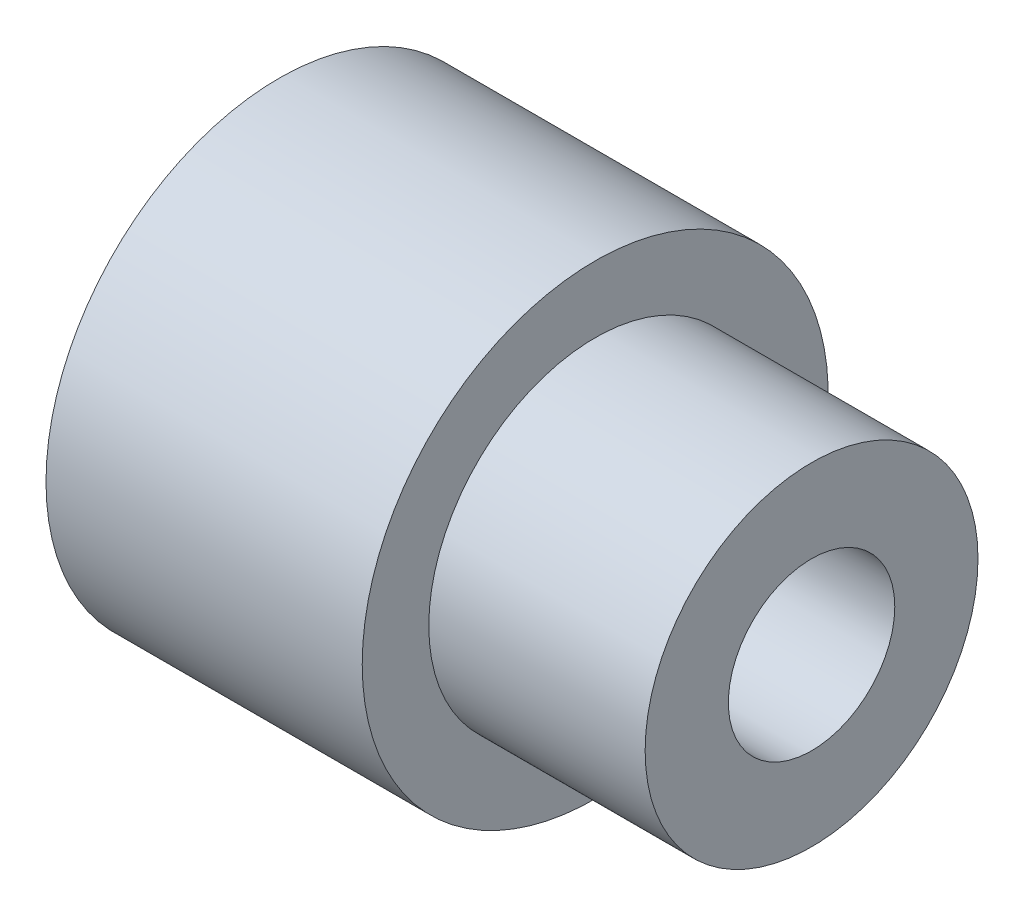
ISO-10303-21;
HEADER;
FILE_DESCRIPTION(('STEP AP214'),'2;1');
FILE_NAME('part.step','',(''),(''),'','','');
FILE_SCHEMA(('AUTOMOTIVE_DESIGN { 1 0 10303 214 1 1 1 1 }'));
ENDSEC;
DATA;
#1=APPLICATION_CONTEXT('core data for automotive mechanical design processes');
#2=APPLICATION_PROTOCOL_DEFINITION('international standard','automotive_design',2000,#1);
#3=PRODUCT_CONTEXT('',#1,'mechanical');
#4=PRODUCT('Part','Part','',(#3));
#5=PRODUCT_RELATED_PRODUCT_CATEGORY('part','',(#4));
#6=PRODUCT_DEFINITION_FORMATION('','',#4);
#7=PRODUCT_DEFINITION_CONTEXT('part definition',#1,'design');
#8=PRODUCT_DEFINITION('design','',#6,#7);
#9=PRODUCT_DEFINITION_SHAPE('','',#8);
#10=(LENGTH_UNIT() NAMED_UNIT(*) SI_UNIT(.MILLI.,.METRE.));
#11=(NAMED_UNIT(*) PLANE_ANGLE_UNIT() SI_UNIT($,.RADIAN.));
#12=(NAMED_UNIT(*) SI_UNIT($,.STERADIAN.) SOLID_ANGLE_UNIT());
#13=UNCERTAINTY_MEASURE_WITH_UNIT(LENGTH_MEASURE(1.E-05),#10,'distance_accuracy_value','');
#14=(GEOMETRIC_REPRESENTATION_CONTEXT(3) GLOBAL_UNCERTAINTY_ASSIGNED_CONTEXT((#13)) GLOBAL_UNIT_ASSIGNED_CONTEXT((#10,
#11,#12)) REPRESENTATION_CONTEXT('',''));
#15=CARTESIAN_POINT('',(0.,0.,0.));
#16=DIRECTION('',(0.,0.,1.));
#17=DIRECTION('',(1.,0.,0.));
#18=AXIS2_PLACEMENT_3D('',#15,#16,#17);
#19=CARTESIAN_POINT('',(13.,0.,0.));
#20=DIRECTION('',(-1.,0.,0.));
#21=DIRECTION('',(0.,0.,1.));
#22=AXIS2_PLACEMENT_3D('',#19,#20,#21);
#23=CYLINDRICAL_SURFACE('',#22,10.);
#24=CARTESIAN_POINT('',(13.,0.,0.));
#25=DIRECTION('',(1.,0.,0.));
#26=DIRECTION('',(0.,0.,-1.));
#27=AXIS2_PLACEMENT_3D('',#24,#25,#26);
#28=CIRCLE('',#27,10.);
#29=CARTESIAN_POINT('',(13.,0.,-10.));
#30=VERTEX_POINT('',#29);
#31=EDGE_CURVE('E43',#30,#30,#28,.T.);
#32=ORIENTED_EDGE('',*,*,#31,.F.);
#33=EDGE_LOOP('',(#32));
#34=FACE_BOUND('',#33,.T.);
#35=CARTESIAN_POINT('',(0.,0.,0.));
#36=DIRECTION('',(1.,0.,0.));
#37=DIRECTION('',(0.,0.,-1.));
#38=AXIS2_PLACEMENT_3D('',#35,#36,#37);
#39=CIRCLE('',#38,10.);
#40=CARTESIAN_POINT('',(0.,0.,-10.));
#41=VERTEX_POINT('',#40);
#42=EDGE_CURVE('E47',#41,#41,#39,.T.);
#43=ORIENTED_EDGE('',*,*,#42,.T.);
#44=EDGE_LOOP('',(#43));
#45=FACE_BOUND('',#44,.T.);
#46=ADVANCED_FACE('F32',(#34,#45),#23,.T.);
#47=CARTESIAN_POINT('',(13.,0.,0.));
#48=DIRECTION('',(1.,0.,0.));
#49=DIRECTION('',(0.,0.,-1.));
#50=AXIS2_PLACEMENT_3D('',#47,#48,#49);
#51=PLANE('',#50);
#52=CARTESIAN_POINT('',(13.,0.,0.));
#53=DIRECTION('',(1.,0.,0.));
#54=DIRECTION('',(0.,0.,-1.));
#55=AXIS2_PLACEMENT_3D('',#52,#53,#54);
#56=CIRCLE('',#55,5.);
#57=CARTESIAN_POINT('',(13.,0.,-5.));
#58=VERTEX_POINT('',#57);
#59=EDGE_CURVE('E54',#58,#58,#56,.T.);
#60=ORIENTED_EDGE('',*,*,#59,.F.);
#61=EDGE_LOOP('',(#60));
#62=FACE_BOUND('',#61,.T.);
#63=ORIENTED_EDGE('',*,*,#31,.T.);
#64=EDGE_LOOP('',(#63));
#65=FACE_BOUND('',#64,.T.);
#66=ADVANCED_FACE('F76',(#62,#65),#51,.T.);
#67=CARTESIAN_POINT('',(-19.,0.,0.));
#68=DIRECTION('',(1.,0.,0.));
#69=DIRECTION('',(0.,0.,-1.));
#70=AXIS2_PLACEMENT_3D('',#67,#68,#69);
#71=CYLINDRICAL_SURFACE('',#70,14.);
#72=CARTESIAN_POINT('',(-19.,0.,0.));
#73=DIRECTION('',(-1.,0.,0.));
#74=DIRECTION('',(0.,0.,1.));
#75=AXIS2_PLACEMENT_3D('',#72,#73,#74);
#76=CIRCLE('',#75,14.);
#77=CARTESIAN_POINT('',(-19.,0.,14.));
#78=VERTEX_POINT('',#77);
#79=EDGE_CURVE('E56',#78,#78,#76,.T.);
#80=ORIENTED_EDGE('',*,*,#79,.F.);
#81=EDGE_LOOP('',(#80));
#82=FACE_BOUND('',#81,.T.);
#83=CARTESIAN_POINT('',(0.,0.,0.));
#84=DIRECTION('',(-1.,0.,0.));
#85=DIRECTION('',(0.,0.,1.));
#86=AXIS2_PLACEMENT_3D('',#83,#84,#85);
#87=CIRCLE('',#86,14.);
#88=CARTESIAN_POINT('',(0.,0.,14.));
#89=VERTEX_POINT('',#88);
#90=EDGE_CURVE('E58',#89,#89,#87,.T.);
#91=ORIENTED_EDGE('',*,*,#90,.T.);
#92=EDGE_LOOP('',(#91));
#93=FACE_BOUND('',#92,.T.);
#94=ADVANCED_FACE('F79',(#82,#93),#71,.T.);
#95=CARTESIAN_POINT('',(-19.,0.,0.));
#96=DIRECTION('',(-1.,0.,0.));
#97=DIRECTION('',(0.,0.,1.));
#98=AXIS2_PLACEMENT_3D('',#95,#96,#97);
#99=PLANE('',#98);
#100=CARTESIAN_POINT('',(-19.,0.,0.));
#101=DIRECTION('',(-1.,0.,0.));
#102=DIRECTION('',(0.,0.,1.));
#103=AXIS2_PLACEMENT_3D('',#100,#101,#102);
#104=CIRCLE('',#103,11.05);
#105=CARTESIAN_POINT('',(-19.,0.,11.05));
#106=VERTEX_POINT('',#105);
#107=EDGE_CURVE('E10',#106,#106,#104,.F.);
#108=ORIENTED_EDGE('',*,*,#107,.T.);
#109=EDGE_LOOP('',(#108));
#110=FACE_BOUND('',#109,.T.);
#111=ORIENTED_EDGE('',*,*,#79,.T.);
#112=EDGE_LOOP('',(#111));
#113=FACE_BOUND('',#112,.T.);
#114=ADVANCED_FACE('F91',(#110,#113),#99,.T.);
#115=CARTESIAN_POINT('',(0.,0.,0.));
#116=DIRECTION('',(-1.,0.,0.));
#117=DIRECTION('',(0.,0.,1.));
#118=AXIS2_PLACEMENT_3D('',#115,#116,#117);
#119=PLANE('',#118);
#120=ORIENTED_EDGE('',*,*,#42,.F.);
#121=EDGE_LOOP('',(#120));
#122=FACE_BOUND('',#121,.T.);
#123=ORIENTED_EDGE('',*,*,#90,.F.);
#124=EDGE_LOOP('',(#123));
#125=FACE_BOUND('',#124,.T.);
#126=ADVANCED_FACE('F87',(#122,#125),#119,.F.);
#127=CARTESIAN_POINT('',(-13.,0.,0.));
#128=DIRECTION('',(-1.,0.,0.));
#129=DIRECTION('',(0.,0.,1.));
#130=AXIS2_PLACEMENT_3D('',#127,#128,#129);
#131=CYLINDRICAL_SURFACE('',#130,11.);
#132=CARTESIAN_POINT('',(-18.95,0.,0.));
#133=DIRECTION('',(-1.,0.,0.));
#134=DIRECTION('',(0.,0.,1.));
#135=AXIS2_PLACEMENT_3D('',#132,#133,#134);
#136=CIRCLE('',#135,11.);
#137=CARTESIAN_POINT('',(-18.95,0.,11.));
#138=VERTEX_POINT('',#137);
#139=EDGE_CURVE('E39',#138,#138,#136,.T.);
#140=ORIENTED_EDGE('',*,*,#139,.T.);
#141=EDGE_LOOP('',(#140));
#142=FACE_BOUND('',#141,.T.);
#143=CARTESIAN_POINT('',(-13.,0.,0.));
#144=DIRECTION('',(-1.,0.,0.));
#145=DIRECTION('',(0.,0.,1.));
#146=AXIS2_PLACEMENT_3D('',#143,#144,#145);
#147=CIRCLE('',#146,11.);
#148=CARTESIAN_POINT('',(-13.,0.,11.));
#149=VERTEX_POINT('',#148);
#150=EDGE_CURVE('E61',#149,#149,#147,.T.);
#151=ORIENTED_EDGE('',*,*,#150,.F.);
#152=EDGE_LOOP('',(#151));
#153=FACE_BOUND('',#152,.T.);
#154=ADVANCED_FACE('F90',(#142,#153),#131,.F.);
#155=CARTESIAN_POINT('',(-13.,0.,0.));
#156=DIRECTION('',(-1.,0.,0.));
#157=DIRECTION('',(0.,0.,1.));
#158=AXIS2_PLACEMENT_3D('',#155,#156,#157);
#159=PLANE('',#158);
#160=CARTESIAN_POINT('',(-13.,0.,0.));
#161=DIRECTION('',(-1.,0.,0.));
#162=DIRECTION('',(0.,0.,1.));
#163=AXIS2_PLACEMENT_3D('',#160,#161,#162);
#164=CIRCLE('',#163,9.);
#165=CARTESIAN_POINT('',(-13.,0.,9.));
#166=VERTEX_POINT('',#165);
#167=EDGE_CURVE('E53',#166,#166,#164,.T.);
#168=ORIENTED_EDGE('',*,*,#167,.F.);
#169=EDGE_LOOP('',(#168));
#170=FACE_BOUND('',#169,.T.);
#171=ORIENTED_EDGE('',*,*,#150,.T.);
#172=EDGE_LOOP('',(#171));
#173=FACE_BOUND('',#172,.T.);
#174=ADVANCED_FACE('F106',(#170,#173),#159,.T.);
#175=CARTESIAN_POINT('',(-3.,0.,0.));
#176=DIRECTION('',(-1.,0.,0.));
#177=DIRECTION('',(0.,0.,1.));
#178=AXIS2_PLACEMENT_3D('',#175,#176,#177);
#179=CYLINDRICAL_SURFACE('',#178,9.);
#180=CARTESIAN_POINT('',(-3.,0.,0.));
#181=DIRECTION('',(-1.,0.,0.));
#182=DIRECTION('',(0.,0.,1.));
#183=AXIS2_PLACEMENT_3D('',#180,#181,#182);
#184=CIRCLE('',#183,9.);
#185=CARTESIAN_POINT('',(-3.,0.,9.));
#186=VERTEX_POINT('',#185);
#187=EDGE_CURVE('E66',#186,#186,#184,.T.);
#188=ORIENTED_EDGE('',*,*,#187,.F.);
#189=EDGE_LOOP('',(#188));
#190=FACE_BOUND('',#189,.T.);
#191=ORIENTED_EDGE('',*,*,#167,.T.);
#192=EDGE_LOOP('',(#191));
#193=FACE_BOUND('',#192,.T.);
#194=ADVANCED_FACE('F109',(#190,#193),#179,.F.);
#195=CARTESIAN_POINT('',(-3.,0.,0.));
#196=DIRECTION('',(-1.,0.,0.));
#197=DIRECTION('',(0.,0.,1.));
#198=AXIS2_PLACEMENT_3D('',#195,#196,#197);
#199=PLANE('',#198);
#200=CARTESIAN_POINT('',(-3.,0.,0.));
#201=DIRECTION('',(-1.,0.,0.));
#202=DIRECTION('',(0.,0.,1.));
#203=AXIS2_PLACEMENT_3D('',#200,#201,#202);
#204=CIRCLE('',#203,5.);
#205=CARTESIAN_POINT('',(-3.,0.,5.));
#206=VERTEX_POINT('',#205);
#207=EDGE_CURVE('E50',#206,#206,#204,.T.);
#208=ORIENTED_EDGE('',*,*,#207,.F.);
#209=EDGE_LOOP('',(#208));
#210=FACE_BOUND('',#209,.T.);
#211=ORIENTED_EDGE('',*,*,#187,.T.);
#212=EDGE_LOOP('',(#211));
#213=FACE_BOUND('',#212,.T.);
#214=ADVANCED_FACE('F113',(#210,#213),#199,.T.);
#215=CARTESIAN_POINT('',(-19.,0.,0.));
#216=DIRECTION('',(1.,0.,0.));
#217=DIRECTION('',(0.,0.,-1.));
#218=AXIS2_PLACEMENT_3D('',#215,#216,#217);
#219=CYLINDRICAL_SURFACE('',#218,5.);
#220=ORIENTED_EDGE('',*,*,#207,.T.);
#221=EDGE_LOOP('',(#220));
#222=FACE_BOUND('',#221,.T.);
#223=ORIENTED_EDGE('',*,*,#59,.T.);
#224=EDGE_LOOP('',(#223));
#225=FACE_BOUND('',#224,.T.);
#226=ADVANCED_FACE('F74',(#222,#225),#219,.F.);
#227=CARTESIAN_POINT('',(-18.95,0.,0.));
#228=DIRECTION('',(-1.,0.,0.));
#229=DIRECTION('',(0.,0.,1.));
#230=AXIS2_PLACEMENT_3D('',#227,#228,#229);
#231=TOROIDAL_SURFACE('',#230,11.05,0.05);
#232=ORIENTED_EDGE('',*,*,#107,.F.);
#233=EDGE_LOOP('',(#232));
#234=FACE_BOUND('',#233,.T.);
#235=ORIENTED_EDGE('',*,*,#139,.F.);
#236=EDGE_LOOP('',(#235));
#237=FACE_BOUND('',#236,.T.);
#238=ADVANCED_FACE('F34',(#234,#237),#231,.T.);
#239=CLOSED_SHELL('',(#46,#66,#94,#114,#126,#154,#174,#194,#214,#226,#238));
#240=MANIFOLD_SOLID_BREP('B2',#239);
#241=ADVANCED_BREP_SHAPE_REPRESENTATION('',(#18,#240),#14);
#242=SHAPE_DEFINITION_REPRESENTATION(#9,#241);
ENDSEC;
END-ISO-10303-21;
